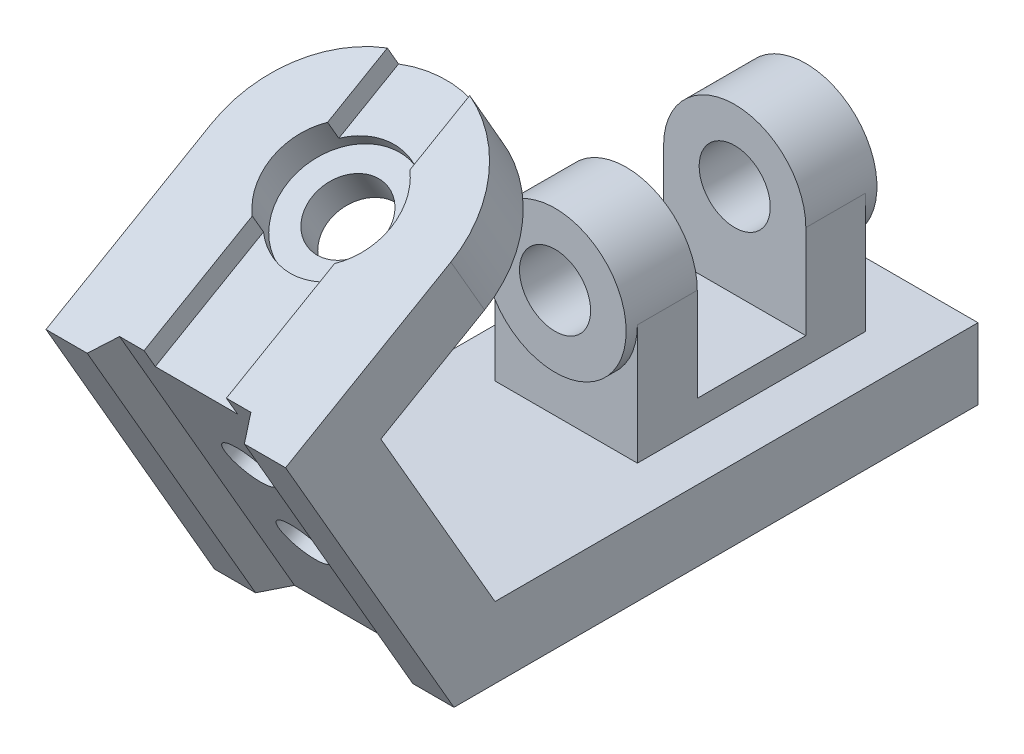
ISO-10303-21;
HEADER;
FILE_DESCRIPTION(('STEP AP214'),'2;1');
FILE_NAME('part.step','',(''),(''),'','','');
FILE_SCHEMA(('AUTOMOTIVE_DESIGN { 1 0 10303 214 1 1 1 1 }'));
ENDSEC;
DATA;
#1=APPLICATION_CONTEXT('core data for automotive mechanical design processes');
#2=APPLICATION_PROTOCOL_DEFINITION('international standard','automotive_design',2000,#1);
#3=PRODUCT_CONTEXT('',#1,'mechanical');
#4=PRODUCT('Part','Part','',(#3));
#5=PRODUCT_RELATED_PRODUCT_CATEGORY('part','',(#4));
#6=PRODUCT_DEFINITION_FORMATION('','',#4);
#7=PRODUCT_DEFINITION_CONTEXT('part definition',#1,'design');
#8=PRODUCT_DEFINITION('design','',#6,#7);
#9=PRODUCT_DEFINITION_SHAPE('','',#8);
#10=(LENGTH_UNIT() NAMED_UNIT(*) SI_UNIT(.MILLI.,.METRE.));
#11=(NAMED_UNIT(*) PLANE_ANGLE_UNIT() SI_UNIT($,.RADIAN.));
#12=(NAMED_UNIT(*) SI_UNIT($,.STERADIAN.) SOLID_ANGLE_UNIT());
#13=UNCERTAINTY_MEASURE_WITH_UNIT(LENGTH_MEASURE(1.E-05),#10,'distance_accuracy_value','');
#14=(GEOMETRIC_REPRESENTATION_CONTEXT(3) GLOBAL_UNCERTAINTY_ASSIGNED_CONTEXT((#13)) GLOBAL_UNIT_ASSIGNED_CONTEXT((#10,
#11,#12)) REPRESENTATION_CONTEXT('',''));
#15=CARTESIAN_POINT('',(0.,0.,0.));
#16=DIRECTION('',(0.,0.,1.));
#17=DIRECTION('',(1.,0.,0.));
#18=AXIS2_PLACEMENT_3D('',#15,#16,#17);
#19=CARTESIAN_POINT('',(19.,70.,-62.));
#20=DIRECTION('',(0.,0.,-1.));
#21=DIRECTION('',(-1.,0.,0.));
#22=AXIS2_PLACEMENT_3D('',#19,#20,#21);
#23=PLANE('',#22);
#24=CARTESIAN_POINT('',(0.,51.,-62.));
#25=DIRECTION('',(0.,0.,1.));
#26=DIRECTION('',(1.,0.,0.));
#27=AXIS2_PLACEMENT_3D('',#24,#25,#26);
#28=CIRCLE('',#27,19.);
#29=CARTESIAN_POINT('',(-19.,51.,-62.));
#30=VERTEX_POINT('',#29);
#31=CARTESIAN_POINT('',(19.,51.,-62.));
#32=VERTEX_POINT('',#31);
#33=EDGE_CURVE('E236',#30,#32,#28,.T.);
#34=ORIENTED_EDGE('',*,*,#33,.F.);
#35=DIRECTION('',(0.,-1.,0.));
#36=VECTOR('',#35,1.);
#37=CARTESIAN_POINT('',(-19.,70.,-62.));
#38=LINE('',#37,#36);
#39=CARTESIAN_POINT('',(-19.,19.,-62.));
#40=VERTEX_POINT('',#39);
#41=EDGE_CURVE('E219',#30,#40,#38,.T.);
#42=ORIENTED_EDGE('',*,*,#41,.T.);
#43=DIRECTION('',(-1.,0.,0.));
#44=VECTOR('',#43,1.);
#45=CARTESIAN_POINT('',(19.,19.,-62.));
#46=LINE('',#45,#44);
#47=CARTESIAN_POINT('',(19.,19.,-62.));
#48=VERTEX_POINT('',#47);
#49=EDGE_CURVE('E288',#48,#40,#46,.T.);
#50=ORIENTED_EDGE('',*,*,#49,.F.);
#51=DIRECTION('',(0.,-1.,0.));
#52=VECTOR('',#51,1.);
#53=CARTESIAN_POINT('',(19.,70.,-62.));
#54=LINE('',#53,#52);
#55=EDGE_CURVE('E242',#32,#48,#54,.T.);
#56=ORIENTED_EDGE('',*,*,#55,.F.);
#57=EDGE_LOOP('',(#34,#42,#50,#56));
#58=FACE_BOUND('',#57,.T.);
#59=ADVANCED_FACE('F34',(#58),#23,.F.);
#60=CARTESIAN_POINT('',(19.,19.,-123.));
#61=DIRECTION('',(0.,0.,1.));
#62=DIRECTION('',(1.,0.,0.));
#63=AXIS2_PLACEMENT_3D('',#60,#61,#62);
#64=PLANE('',#63);
#65=CARTESIAN_POINT('',(0.,51.,-123.));
#66=DIRECTION('',(0.,0.,-1.));
#67=DIRECTION('',(-1.,0.,0.));
#68=AXIS2_PLACEMENT_3D('',#65,#66,#67);
#69=CIRCLE('',#68,19.);
#70=CARTESIAN_POINT('',(19.,51.,-123.));
#71=VERTEX_POINT('',#70);
#72=CARTESIAN_POINT('',(-19.,51.,-123.));
#73=VERTEX_POINT('',#72);
#74=EDGE_CURVE('E247',#71,#73,#69,.T.);
#75=ORIENTED_EDGE('',*,*,#74,.F.);
#76=DIRECTION('',(0.,1.,0.));
#77=VECTOR('',#76,1.);
#78=CARTESIAN_POINT('',(19.,19.,-123.));
#79=LINE('',#78,#77);
#80=CARTESIAN_POINT('',(19.,19.,-123.));
#81=VERTEX_POINT('',#80);
#82=EDGE_CURVE('E262',#81,#71,#79,.T.);
#83=ORIENTED_EDGE('',*,*,#82,.F.);
#84=DIRECTION('',(-1.,0.,0.));
#85=VECTOR('',#84,1.);
#86=CARTESIAN_POINT('',(19.,19.,-123.));
#87=LINE('',#86,#85);
#88=CARTESIAN_POINT('',(-19.,19.,-123.));
#89=VERTEX_POINT('',#88);
#90=EDGE_CURVE('E285',#81,#89,#87,.T.);
#91=ORIENTED_EDGE('',*,*,#90,.T.);
#92=DIRECTION('',(0.,1.,0.));
#93=VECTOR('',#92,1.);
#94=CARTESIAN_POINT('',(-19.,19.,-123.));
#95=LINE('',#94,#93);
#96=EDGE_CURVE('E273',#89,#73,#95,.T.);
#97=ORIENTED_EDGE('',*,*,#96,.T.);
#98=EDGE_LOOP('',(#75,#83,#91,#97));
#99=FACE_BOUND('',#98,.T.);
#100=ADVANCED_FACE('F480',(#99),#64,.F.);
#101=CARTESIAN_POINT('',(0.,51.,-107.));
#102=DIRECTION('',(0.,0.,1.));
#103=DIRECTION('',(1.,0.,0.));
#104=AXIS2_PLACEMENT_3D('',#101,#102,#103);
#105=CYLINDRICAL_SURFACE('',#104,19.);
#106=DIRECTION('',(0.,0.,1.));
#107=VECTOR('',#106,1.);
#108=CARTESIAN_POINT('',(-19.,51.,0.));
#109=LINE('',#108,#107);
#110=CARTESIAN_POINT('',(-19.,51.,-107.));
#111=VERTEX_POINT('',#110);
#112=EDGE_CURVE('E55',#111,#73,#109,.F.);
#113=ORIENTED_EDGE('',*,*,#112,.F.);
#114=CARTESIAN_POINT('',(0.,51.,-107.));
#115=DIRECTION('',(0.,0.,-1.));
#116=DIRECTION('',(-1.,0.,0.));
#117=AXIS2_PLACEMENT_3D('',#114,#115,#116);
#118=CIRCLE('',#117,19.);
#119=CARTESIAN_POINT('',(19.,51.,-107.));
#120=VERTEX_POINT('',#119);
#121=EDGE_CURVE('E11',#120,#111,#118,.F.);
#122=ORIENTED_EDGE('',*,*,#121,.F.);
#123=DIRECTION('',(0.,0.,-1.));
#124=VECTOR('',#123,1.);
#125=CARTESIAN_POINT('',(19.,51.,-107.));
#126=LINE('',#125,#124);
#127=EDGE_CURVE('E43',#71,#120,#126,.F.);
#128=ORIENTED_EDGE('',*,*,#127,.F.);
#129=ORIENTED_EDGE('',*,*,#74,.T.);
#130=EDGE_LOOP('',(#113,#122,#128,#129));
#131=FACE_BOUND('',#130,.T.);
#132=CARTESIAN_POINT('',(0.,51.,-126.));
#133=DIRECTION('',(0.,0.,-1.));
#134=DIRECTION('',(-1.,0.,0.));
#135=AXIS2_PLACEMENT_3D('',#132,#133,#134);
#136=CIRCLE('',#135,19.);
#137=CARTESIAN_POINT('',(-19.,51.,-126.));
#138=VERTEX_POINT('',#137);
#139=EDGE_CURVE('E230',#138,#138,#136,.T.);
#140=ORIENTED_EDGE('',*,*,#139,.F.);
#141=EDGE_LOOP('',(#140));
#142=FACE_BOUND('',#141,.T.);
#143=ADVANCED_FACE('F37',(#131,#142),#105,.T.);
#144=CARTESIAN_POINT('',(0.,51.,-62.));
#145=DIRECTION('',(0.,0.,1.));
#146=DIRECTION('',(1.,0.,0.));
#147=AXIS2_PLACEMENT_3D('',#144,#145,#146);
#148=CYLINDRICAL_SURFACE('',#147,19.);
#149=DIRECTION('',(0.,0.,1.));
#150=VECTOR('',#149,1.);
#151=CARTESIAN_POINT('',(-19.,51.,0.));
#152=LINE('',#151,#150);
#153=CARTESIAN_POINT('',(-19.,51.,-78.));
#154=VERTEX_POINT('',#153);
#155=EDGE_CURVE('E223',#30,#154,#152,.F.);
#156=ORIENTED_EDGE('',*,*,#155,.F.);
#157=ORIENTED_EDGE('',*,*,#33,.T.);
#158=DIRECTION('',(0.,0.,-1.));
#159=VECTOR('',#158,1.);
#160=CARTESIAN_POINT('',(19.,51.,-62.));
#161=LINE('',#160,#159);
#162=CARTESIAN_POINT('',(19.,51.,-78.));
#163=VERTEX_POINT('',#162);
#164=EDGE_CURVE('E450',#163,#32,#161,.F.);
#165=ORIENTED_EDGE('',*,*,#164,.F.);
#166=CARTESIAN_POINT('',(0.,51.,-78.));
#167=DIRECTION('',(0.,0.,1.));
#168=DIRECTION('',(1.,0.,0.));
#169=AXIS2_PLACEMENT_3D('',#166,#167,#168);
#170=CIRCLE('',#169,19.);
#171=EDGE_CURVE('E238',#154,#163,#170,.F.);
#172=ORIENTED_EDGE('',*,*,#171,.F.);
#173=EDGE_LOOP('',(#156,#157,#165,#172));
#174=FACE_BOUND('',#173,.T.);
#175=CARTESIAN_POINT('',(0.,51.,-59.));
#176=DIRECTION('',(0.,0.,1.));
#177=DIRECTION('',(1.,0.,0.));
#178=AXIS2_PLACEMENT_3D('',#175,#176,#177);
#179=CIRCLE('',#178,19.);
#180=CARTESIAN_POINT('',(19.,51.,-59.));
#181=VERTEX_POINT('',#180);
#182=EDGE_CURVE('E243',#181,#181,#179,.T.);
#183=ORIENTED_EDGE('',*,*,#182,.F.);
#184=EDGE_LOOP('',(#183));
#185=FACE_BOUND('',#184,.T.);
#186=ADVANCED_FACE('F234',(#174,#185),#148,.T.);
#187=CARTESIAN_POINT('',(32.,77.9422863405996,44.9999999999998));
#188=DIRECTION('',(0.,0.499999999999998,-0.86602540378444));
#189=DIRECTION('',(0.,0.86602540378444,0.499999999999998));
#190=AXIS2_PLACEMENT_3D('',#187,#188,#189);
#191=PLANE('',#190);
#192=DIRECTION('',(-1.,0.,0.));
#193=VECTOR('',#192,1.);
#194=CARTESIAN_POINT('',(32.,0.,0.));
#195=LINE('',#194,#193);
#196=CARTESIAN_POINT('',(-21.,0.,0.));
#197=VERTEX_POINT('',#196);
#198=CARTESIAN_POINT('',(-32.,0.,0.));
#199=VERTEX_POINT('',#198);
#200=EDGE_CURVE('E422',#197,#199,#195,.T.);
#201=ORIENTED_EDGE('',*,*,#200,.F.);
#202=DIRECTION('',(0.,0.86602540378444,0.499999999999998));
#203=VECTOR('',#202,1.);
#204=CARTESIAN_POINT('',(-21.,-60.6217782649106,-34.9999999999998));
#205=LINE('',#204,#203);
#206=CARTESIAN_POINT('',(-21.,77.9422863405996,44.9999999999998));
#207=VERTEX_POINT('',#206);
#208=EDGE_CURVE('E310',#197,#207,#205,.T.);
#209=ORIENTED_EDGE('',*,*,#208,.T.);
#210=DIRECTION('',(-1.,0.,0.));
#211=VECTOR('',#210,1.);
#212=CARTESIAN_POINT('',(32.,77.9422863405996,44.9999999999998));
#213=LINE('',#212,#211);
#214=CARTESIAN_POINT('',(-32.,77.9422863405996,44.9999999999998));
#215=VERTEX_POINT('',#214);
#216=EDGE_CURVE('E391',#207,#215,#213,.T.);
#217=ORIENTED_EDGE('',*,*,#216,.T.);
#218=DIRECTION('',(0.,-0.86602540378444,-0.499999999999998));
#219=VECTOR('',#218,1.);
#220=CARTESIAN_POINT('',(-32.,77.9422863405996,44.9999999999998));
#221=LINE('',#220,#219);
#222=EDGE_CURVE('E371',#215,#199,#221,.T.);
#223=ORIENTED_EDGE('',*,*,#222,.T.);
#224=EDGE_LOOP('',(#201,#209,#217,#223));
#225=FACE_BOUND('',#224,.T.);
#226=ADVANCED_FACE('F548',(#225),#191,.F.);
#227=CARTESIAN_POINT('',(32.,119.4422863406,-26.880108514109));
#228=DIRECTION('',(0.,-0.86602540378444,-0.499999999999998));
#229=DIRECTION('',(0.,0.499999999999998,-0.86602540378444));
#230=AXIS2_PLACEMENT_3D('',#227,#228,#229);
#231=PLANE('',#230);
#232=DIRECTION('',(0.,0.499999999999998,-0.86602540378444));
#233=VECTOR('',#232,1.);
#234=CARTESIAN_POINT('',(11.,77.9422863405996,44.9999999999998));
#235=LINE('',#234,#233);
#236=CARTESIAN_POINT('',(11.,80.9422863405996,39.8038475772932));
#237=VERTEX_POINT('',#236);
#238=CARTESIAN_POINT('',(11.,97.6328113212885,10.8950103057422));
#239=VERTEX_POINT('',#238);
#240=EDGE_CURVE('E363',#237,#239,#235,.T.);
#241=ORIENTED_EDGE('',*,*,#240,.F.);
#242=DIRECTION('',(-1.,0.,0.));
#243=VECTOR('',#242,1.);
#244=CARTESIAN_POINT('',(17.5358983848623,80.9422863405996,39.8038475772932));
#245=LINE('',#244,#243);
#246=CARTESIAN_POINT('',(17.5358983848623,80.9422863405996,39.8038475772932));
#247=VERTEX_POINT('',#246);
#248=EDGE_CURVE('E308',#247,#237,#245,.T.);
#249=ORIENTED_EDGE('',*,*,#248,.F.);
#250=DIRECTION('',(-0.499999999999995,0.433012701892219,-0.750000000000004));
#251=VECTOR('',#250,1.);
#252=CARTESIAN_POINT('',(21.,77.9422863405996,44.9999999999998));
#253=LINE('',#252,#251);
#254=CARTESIAN_POINT('',(21.,77.9422863405996,44.9999999999998));
#255=VERTEX_POINT('',#254);
#256=EDGE_CURVE('E304',#255,#247,#253,.T.);
#257=ORIENTED_EDGE('',*,*,#256,.F.);
#258=CARTESIAN_POINT('',(32.,77.9422863405996,44.9999999999998));
#259=VERTEX_POINT('',#258);
#260=EDGE_CURVE('E407',#259,#255,#213,.T.);
#261=ORIENTED_EDGE('',*,*,#260,.F.);
#262=DIRECTION('',(0.,-0.499999999999998,0.86602540378444));
#263=VECTOR('',#262,1.);
#264=CARTESIAN_POINT('',(32.,119.4422863406,-26.880108514109));
#265=LINE('',#264,#263);
#266=CARTESIAN_POINT('',(32.,103.4422863406,0.832704406993078));
#267=VERTEX_POINT('',#266);
#268=EDGE_CURVE('E389',#267,#259,#265,.T.);
#269=ORIENTED_EDGE('',*,*,#268,.F.);
#270=CARTESIAN_POINT('',(0.,103.4422863406,0.832704406993078));
#271=DIRECTION('',(0.,-0.86602540378444,-0.499999999999998));
#272=DIRECTION('',(0.,0.499999999999998,-0.86602540378444));
#273=AXIS2_PLACEMENT_3D('',#270,#271,#272);
#274=CIRCLE('',#273,32.);
#275=CARTESIAN_POINT('',(11.,118.467265541916,-25.1913229523532));
#276=VERTEX_POINT('',#275);
#277=EDGE_CURVE('E433',#267,#276,#274,.F.);
#278=ORIENTED_EDGE('',*,*,#277,.T.);
#279=CARTESIAN_POINT('',(11.,109.251761359911,-9.229601491756));
#280=VERTEX_POINT('',#279);
#281=EDGE_CURVE('E352',#280,#276,#235,.T.);
#282=ORIENTED_EDGE('',*,*,#281,.F.);
#283=CARTESIAN_POINT('',(0.,103.4422863406,0.832704406993082));
#284=DIRECTION('',(0.,0.86602540378444,0.499999999999998));
#285=DIRECTION('',(0.,-0.499999999999998,0.86602540378444));
#286=AXIS2_PLACEMENT_3D('',#283,#284,#285);
#287=CIRCLE('',#286,16.);
#288=EDGE_CURVE('E329',#239,#280,#287,.T.);
#289=ORIENTED_EDGE('',*,*,#288,.F.);
#290=EDGE_LOOP('',(#241,#249,#257,#261,#269,#278,#282,#289));
#291=FACE_BOUND('',#290,.T.);
#292=ADVANCED_FACE('F545',(#291),#231,.F.);
#293=CARTESIAN_POINT('',(-11.,72.7461339178929,41.9999999999999));
#294=DIRECTION('',(-1.,0.,0.));
#295=DIRECTION('',(0.,0.,1.));
#296=AXIS2_PLACEMENT_3D('',#293,#294,#295);
#297=PLANE('',#296);
#298=DIRECTION('',(0.,-0.499999999999998,0.86602540378444));
#299=VECTOR('',#298,1.);
#300=CARTESIAN_POINT('',(-11.,77.9422863405996,44.9999999999998));
#301=LINE('',#300,#299);
#302=CARTESIAN_POINT('',(-11.,97.6328113212885,10.8950103057422));
#303=VERTEX_POINT('',#302);
#304=CARTESIAN_POINT('',(-11.,80.9422863405996,39.8038475772932));
#305=VERTEX_POINT('',#304);
#306=EDGE_CURVE('E365',#303,#305,#301,.T.);
#307=ORIENTED_EDGE('',*,*,#306,.T.);
#308=DIRECTION('',(0.,-0.86602540378444,-0.499999999999998));
#309=VECTOR('',#308,1.);
#310=CARTESIAN_POINT('',(-11.,75.7461339178929,36.8038475772932));
#311=LINE('',#310,#309);
#312=CARTESIAN_POINT('',(-11.,75.7461339178929,36.8038475772932));
#313=VERTEX_POINT('',#312);
#314=EDGE_CURVE('E322',#305,#313,#311,.T.);
#315=ORIENTED_EDGE('',*,*,#314,.T.);
#316=DIRECTION('',(0.,-0.499999999999998,0.86602540378444));
#317=VECTOR('',#316,1.);
#318=CARTESIAN_POINT('',(-11.,72.7461339178929,41.9999999999999));
#319=LINE('',#318,#317);
#320=CARTESIAN_POINT('',(-11.,92.4366588985819,7.89501030574217));
#321=VERTEX_POINT('',#320);
#322=EDGE_CURVE('E358',#321,#313,#319,.T.);
#323=ORIENTED_EDGE('',*,*,#322,.F.);
#324=DIRECTION('',(0.,0.86602540378444,0.499999999999998));
#325=VECTOR('',#324,1.);
#326=CARTESIAN_POINT('',(-11.,97.6328113212885,10.8950103057422));
#327=LINE('',#326,#325);
#328=EDGE_CURVE('E343',#321,#303,#327,.T.);
#329=ORIENTED_EDGE('',*,*,#328,.T.);
#330=EDGE_LOOP('',(#307,#315,#323,#329));
#331=FACE_BOUND('',#330,.T.);
#332=ADVANCED_FACE('F532',(#331),#297,.F.);
#333=CARTESIAN_POINT('',(11.,72.7461339178929,41.9999999999998));
#334=DIRECTION('',(1.,0.,0.));
#335=DIRECTION('',(0.,0.,-1.));
#336=AXIS2_PLACEMENT_3D('',#333,#334,#335);
#337=PLANE('',#336);
#338=DIRECTION('',(0.,0.499999999999998,-0.86602540378444));
#339=VECTOR('',#338,1.);
#340=CARTESIAN_POINT('',(11.,72.7461339178929,41.9999999999998));
#341=LINE('',#340,#339);
#342=CARTESIAN_POINT('',(11.,104.055608937204,-12.229601491756));
#343=VERTEX_POINT('',#342);
#344=CARTESIAN_POINT('',(11.,113.27111311921,-28.1913229523531));
#345=VERTEX_POINT('',#344);
#346=EDGE_CURVE('E356',#343,#345,#341,.T.);
#347=ORIENTED_EDGE('',*,*,#346,.F.);
#348=DIRECTION('',(0.,0.86602540378444,0.499999999999998));
#349=VECTOR('',#348,1.);
#350=CARTESIAN_POINT('',(11.,109.251761359911,-9.229601491756));
#351=LINE('',#350,#349);
#352=EDGE_CURVE('E349',#343,#280,#351,.T.);
#353=ORIENTED_EDGE('',*,*,#352,.T.);
#354=ORIENTED_EDGE('',*,*,#281,.T.);
#355=DIRECTION('',(0.,0.86602540378444,0.499999999999998));
#356=VECTOR('',#355,1.);
#357=CARTESIAN_POINT('',(11.,113.27111311921,-28.1913229523531));
#358=LINE('',#357,#356);
#359=EDGE_CURVE('E362',#345,#276,#358,.T.);
#360=ORIENTED_EDGE('',*,*,#359,.F.);
#361=EDGE_LOOP('',(#347,#353,#354,#360));
#362=FACE_BOUND('',#361,.T.);
#363=ADVANCED_FACE('F536',(#362),#337,.F.);
#364=CARTESIAN_POINT('',(0.,98.246133917893,-2.16729559300691));
#365=DIRECTION('',(0.,0.86602540378444,0.499999999999998));
#366=DIRECTION('',(0.,-0.499999999999998,0.86602540378444));
#367=AXIS2_PLACEMENT_3D('',#364,#365,#366);
#368=PLANE('',#367);
#369=CARTESIAN_POINT('',(0.,98.246133917893,-2.16729559300691));
#370=DIRECTION('',(0.,0.86602540378444,0.499999999999998));
#371=DIRECTION('',(0.,-0.499999999999998,0.86602540378444));
#372=AXIS2_PLACEMENT_3D('',#369,#370,#371);
#373=CIRCLE('',#372,16.);
#374=CARTESIAN_POINT('',(-11.,104.055608937204,-12.229601491756));
#375=VERTEX_POINT('',#374);
#376=EDGE_CURVE('E441',#343,#375,#373,.T.);
#377=ORIENTED_EDGE('',*,*,#376,.F.);
#378=ORIENTED_EDGE('',*,*,#346,.T.);
#379=CARTESIAN_POINT('',(0.,98.246133917893,-2.16729559300691));
#380=DIRECTION('',(0.,0.86602540378444,0.499999999999998));
#381=DIRECTION('',(0.,-0.499999999999998,0.86602540378444));
#382=AXIS2_PLACEMENT_3D('',#379,#380,#381);
#383=CIRCLE('',#382,32.);
#384=CARTESIAN_POINT('',(-11.,113.27111311921,-28.1913229523531));
#385=VERTEX_POINT('',#384);
#386=EDGE_CURVE('E355',#345,#385,#383,.T.);
#387=ORIENTED_EDGE('',*,*,#386,.T.);
#388=EDGE_CURVE('E359',#385,#375,#319,.T.);
#389=ORIENTED_EDGE('',*,*,#388,.T.);
#390=EDGE_LOOP('',(#377,#378,#387,#389));
#391=FACE_BOUND('',#390,.T.);
#392=ADVANCED_FACE('F526',(#391),#368,.T.);
#393=ORIENTED_EDGE('',*,*,#216,.F.);
#394=DIRECTION('',(-0.500000000000003,-0.433012701892217,0.749999999999999));
#395=VECTOR('',#394,1.);
#396=CARTESIAN_POINT('',(-17.5358983848622,80.9422863405996,39.8038475772932));
#397=LINE('',#396,#395);
#398=CARTESIAN_POINT('',(-17.5358983848622,80.9422863405996,39.8038475772932));
#399=VERTEX_POINT('',#398);
#400=EDGE_CURVE('E302',#399,#207,#397,.T.);
#401=ORIENTED_EDGE('',*,*,#400,.F.);
#402=EDGE_CURVE('E307',#305,#399,#245,.T.);
#403=ORIENTED_EDGE('',*,*,#402,.F.);
#404=ORIENTED_EDGE('',*,*,#306,.F.);
#405=CARTESIAN_POINT('',(-11.,109.251761359911,-9.229601491756));
#406=VERTEX_POINT('',#405);
#407=EDGE_CURVE('E328',#406,#303,#287,.T.);
#408=ORIENTED_EDGE('',*,*,#407,.F.);
#409=CARTESIAN_POINT('',(-11.,118.467265541916,-25.1913229523532));
#410=VERTEX_POINT('',#409);
#411=EDGE_CURVE('E366',#410,#406,#301,.T.);
#412=ORIENTED_EDGE('',*,*,#411,.F.);
#413=CARTESIAN_POINT('',(-32.,103.4422863406,0.832704406993078));
#414=VERTEX_POINT('',#413);
#415=EDGE_CURVE('E432',#410,#414,#274,.F.);
#416=ORIENTED_EDGE('',*,*,#415,.T.);
#417=DIRECTION('',(0.,-0.499999999999998,0.86602540378444));
#418=VECTOR('',#417,1.);
#419=CARTESIAN_POINT('',(-32.,119.4422863406,-26.880108514109));
#420=LINE('',#419,#418);
#421=EDGE_CURVE('E378',#414,#215,#420,.T.);
#422=ORIENTED_EDGE('',*,*,#421,.T.);
#423=EDGE_LOOP('',(#393,#401,#403,#404,#408,#412,#416,#422));
#424=FACE_BOUND('',#423,.T.);
#425=ADVANCED_FACE('F550',(#424),#231,.F.);
#426=CARTESIAN_POINT('',(0.,103.4422863406,0.832704406993078));
#427=DIRECTION('',(0.,0.866025403784444,0.49999999999999));
#428=DIRECTION('',(0.,-0.49999999999999,0.866025403784444));
#429=AXIS2_PLACEMENT_3D('',#426,#427,#428);
#430=CYLINDRICAL_SURFACE('',#429,32.);
#431=DIRECTION('',(0.,0.86602540378444,0.499999999999998));
#432=VECTOR('',#431,1.);
#433=CARTESIAN_POINT('',(-11.,113.27111311921,-28.1913229523531));
#434=LINE('',#433,#432);
#435=EDGE_CURVE('E369',#385,#410,#434,.T.);
#436=ORIENTED_EDGE('',*,*,#435,.F.);
#437=ORIENTED_EDGE('',*,*,#386,.F.);
#438=ORIENTED_EDGE('',*,*,#359,.T.);
#439=ORIENTED_EDGE('',*,*,#277,.F.);
#440=DIRECTION('',(0.,-0.866025403784444,-0.49999999999999));
#441=VECTOR('',#440,1.);
#442=CARTESIAN_POINT('',(32.,103.4422863406,0.832704406993078));
#443=LINE('',#442,#441);
#444=CARTESIAN_POINT('',(32.,87.85382907248,-8.16729559300656));
#445=VERTEX_POINT('',#444);
#446=EDGE_CURVE('E429',#445,#267,#443,.F.);
#447=ORIENTED_EDGE('',*,*,#446,.F.);
#448=CARTESIAN_POINT('',(0.,87.85382907248,-8.16729559300656));
#449=DIRECTION('',(0.,0.866025403784445,0.499999999999989));
#450=DIRECTION('',(0.,-0.499999999999989,0.866025403784445));
#451=AXIS2_PLACEMENT_3D('',#448,#449,#450);
#452=CIRCLE('',#451,32.);
#453=CARTESIAN_POINT('',(-32.,87.85382907248,-8.16729559300656));
#454=VERTEX_POINT('',#453);
#455=EDGE_CURVE('E436',#454,#445,#452,.F.);
#456=ORIENTED_EDGE('',*,*,#455,.F.);
#457=DIRECTION('',(0.,0.866025403784444,0.49999999999999));
#458=VECTOR('',#457,1.);
#459=CARTESIAN_POINT('',(-32.,25.4999999999993,-44.1672955930063));
#460=LINE('',#459,#458);
#461=EDGE_CURVE('E426',#414,#454,#460,.F.);
#462=ORIENTED_EDGE('',*,*,#461,.F.);
#463=ORIENTED_EDGE('',*,*,#415,.F.);
#464=EDGE_LOOP('',(#436,#437,#438,#439,#447,#456,#462,#463));
#465=FACE_BOUND('',#464,.T.);
#466=ADVANCED_FACE('F573',(#465),#430,.T.);
#467=ORIENTED_EDGE('',*,*,#260,.T.);
#468=DIRECTION('',(0.,0.86602540378444,0.499999999999998));
#469=VECTOR('',#468,1.);
#470=CARTESIAN_POINT('',(21.,-60.6217782649106,-34.9999999999998));
#471=LINE('',#470,#469);
#472=CARTESIAN_POINT('',(21.,0.,0.));
#473=VERTEX_POINT('',#472);
#474=EDGE_CURVE('E316',#473,#255,#471,.T.);
#475=ORIENTED_EDGE('',*,*,#474,.F.);
#476=CARTESIAN_POINT('',(32.,0.,0.));
#477=VERTEX_POINT('',#476);
#478=EDGE_CURVE('E423',#477,#473,#195,.T.);
#479=ORIENTED_EDGE('',*,*,#478,.F.);
#480=DIRECTION('',(0.,-0.86602540378444,-0.499999999999998));
#481=VECTOR('',#480,1.);
#482=CARTESIAN_POINT('',(32.,77.9422863405996,44.9999999999998));
#483=LINE('',#482,#481);
#484=EDGE_CURVE('E374',#259,#477,#483,.T.);
#485=ORIENTED_EDGE('',*,*,#484,.F.);
#486=EDGE_LOOP('',(#467,#475,#479,#485));
#487=FACE_BOUND('',#486,.T.);
#488=ADVANCED_FACE('F569',(#487),#191,.F.);
#489=CARTESIAN_POINT('',(32.,0.,0.));
#490=DIRECTION('',(0.,1.,0.));
#491=DIRECTION('',(0.,0.,1.));
#492=AXIS2_PLACEMENT_3D('',#489,#490,#491);
#493=PLANE('',#492);
#494=DIRECTION('',(-1.,0.,0.));
#495=VECTOR('',#494,1.);
#496=CARTESIAN_POINT('',(32.,0.,-6.92820323027554));
#497=LINE('',#496,#495);
#498=CARTESIAN_POINT('',(17.5358983848623,0.,-6.92820323027554));
#499=VERTEX_POINT('',#498);
#500=CARTESIAN_POINT('',(-17.5358983848622,0.,-6.92820323027554));
#501=VERTEX_POINT('',#500);
#502=EDGE_CURVE('E325',#499,#501,#497,.T.);
#503=ORIENTED_EDGE('',*,*,#502,.T.);
#504=DIRECTION('',(-0.447213595499961,0.,0.894427190999914));
#505=VECTOR('',#504,1.);
#506=CARTESIAN_POINT('',(-10.3999999999999,0.,-21.2000000000001));
#507=LINE('',#506,#505);
#508=EDGE_CURVE('E239',#501,#197,#507,.T.);
#509=ORIENTED_EDGE('',*,*,#508,.T.);
#510=ORIENTED_EDGE('',*,*,#200,.T.);
#511=DIRECTION('',(0.,0.,-1.));
#512=VECTOR('',#511,1.);
#513=CARTESIAN_POINT('',(-32.,0.,0.));
#514=LINE('',#513,#512);
#515=CARTESIAN_POINT('',(-32.,0.,-140.));
#516=VERTEX_POINT('',#515);
#517=EDGE_CURVE('E394',#199,#516,#514,.T.);
#518=ORIENTED_EDGE('',*,*,#517,.T.);
#519=DIRECTION('',(-1.,0.,0.));
#520=VECTOR('',#519,1.);
#521=CARTESIAN_POINT('',(32.,0.,-140.));
#522=LINE('',#521,#520);
#523=CARTESIAN_POINT('',(32.,0.,-140.));
#524=VERTEX_POINT('',#523);
#525=EDGE_CURVE('E419',#524,#516,#522,.T.);
#526=ORIENTED_EDGE('',*,*,#525,.F.);
#527=DIRECTION('',(0.,0.,-1.));
#528=VECTOR('',#527,1.);
#529=CARTESIAN_POINT('',(32.,0.,0.));
#530=LINE('',#529,#528);
#531=EDGE_CURVE('E377',#477,#524,#530,.T.);
#532=ORIENTED_EDGE('',*,*,#531,.F.);
#533=ORIENTED_EDGE('',*,*,#478,.T.);
#534=DIRECTION('',(-0.447213595499954,0.,-0.894427190999918));
#535=VECTOR('',#534,1.);
#536=CARTESIAN_POINT('',(23.2,0.,4.39999999999996));
#537=LINE('',#536,#535);
#538=EDGE_CURVE('E444',#473,#499,#537,.T.);
#539=ORIENTED_EDGE('',*,*,#538,.T.);
#540=EDGE_LOOP('',(#503,#509,#510,#518,#526,#532,#533,#539));
#541=FACE_BOUND('',#540,.T.);
#542=ADVANCED_FACE('F565',(#541),#493,.F.);
#543=CARTESIAN_POINT('',(32.,0.,-140.));
#544=DIRECTION('',(0.,0.,1.));
#545=DIRECTION('',(1.,0.,0.));
#546=AXIS2_PLACEMENT_3D('',#543,#544,#545);
#547=PLANE('',#546);
#548=DIRECTION('',(0.,1.,0.));
#549=VECTOR('',#548,1.);
#550=CARTESIAN_POINT('',(-32.,0.,-140.));
#551=LINE('',#550,#549);
#552=CARTESIAN_POINT('',(-32.,19.,-140.));
#553=VERTEX_POINT('',#552);
#554=EDGE_CURVE('E396',#516,#553,#551,.T.);
#555=ORIENTED_EDGE('',*,*,#554,.T.);
#556=DIRECTION('',(-1.,0.,0.));
#557=VECTOR('',#556,1.);
#558=CARTESIAN_POINT('',(32.,19.,-140.));
#559=LINE('',#558,#557);
#560=CARTESIAN_POINT('',(32.,19.,-140.));
#561=VERTEX_POINT('',#560);
#562=EDGE_CURVE('E416',#561,#553,#559,.T.);
#563=ORIENTED_EDGE('',*,*,#562,.F.);
#564=DIRECTION('',(0.,1.,0.));
#565=VECTOR('',#564,1.);
#566=CARTESIAN_POINT('',(32.,0.,-140.));
#567=LINE('',#566,#565);
#568=EDGE_CURVE('E380',#524,#561,#567,.T.);
#569=ORIENTED_EDGE('',*,*,#568,.F.);
#570=ORIENTED_EDGE('',*,*,#525,.T.);
#571=EDGE_LOOP('',(#555,#563,#569,#570));
#572=FACE_BOUND('',#571,.T.);
#573=ADVANCED_FACE('F561',(#572),#547,.F.);
#574=CARTESIAN_POINT('',(32.,19.,-140.));
#575=DIRECTION('',(0.,-1.,0.));
#576=DIRECTION('',(0.,0.,-1.));
#577=AXIS2_PLACEMENT_3D('',#574,#575,#576);
#578=PLANE('',#577);
#579=ORIENTED_EDGE('',*,*,#90,.F.);
#580=DIRECTION('',(0.,0.,-1.));
#581=VECTOR('',#580,1.);
#582=CARTESIAN_POINT('',(19.,19.,-62.));
#583=LINE('',#582,#581);
#584=EDGE_CURVE('E258',#48,#81,#583,.T.);
#585=ORIENTED_EDGE('',*,*,#584,.F.);
#586=ORIENTED_EDGE('',*,*,#49,.T.);
#587=DIRECTION('',(0.,0.,-1.));
#588=VECTOR('',#587,1.);
#589=CARTESIAN_POINT('',(-19.,19.,-62.));
#590=LINE('',#589,#588);
#591=EDGE_CURVE('E225',#40,#89,#590,.T.);
#592=ORIENTED_EDGE('',*,*,#591,.T.);
#593=EDGE_LOOP('',(#579,#585,#586,#592));
#594=FACE_BOUND('',#593,.T.);
#595=DIRECTION('',(0.,0.,1.));
#596=VECTOR('',#595,1.);
#597=CARTESIAN_POINT('',(-32.,19.,-140.));
#598=LINE('',#597,#596);
#599=CARTESIAN_POINT('',(-32.,19.,-10.9696551146032));
#600=VERTEX_POINT('',#599);
#601=EDGE_CURVE('E398',#553,#600,#598,.T.);
#602=ORIENTED_EDGE('',*,*,#601,.T.);
#603=DIRECTION('',(-1.,0.,0.));
#604=VECTOR('',#603,1.);
#605=CARTESIAN_POINT('',(32.,19.,-10.9696551146032));
#606=LINE('',#605,#604);
#607=CARTESIAN_POINT('',(32.,19.,-10.9696551146032));
#608=VERTEX_POINT('',#607);
#609=EDGE_CURVE('E413',#608,#600,#606,.T.);
#610=ORIENTED_EDGE('',*,*,#609,.F.);
#611=DIRECTION('',(0.,0.,1.));
#612=VECTOR('',#611,1.);
#613=CARTESIAN_POINT('',(32.,19.,-140.));
#614=LINE('',#613,#612);
#615=EDGE_CURVE('E382',#561,#608,#614,.T.);
#616=ORIENTED_EDGE('',*,*,#615,.F.);
#617=ORIENTED_EDGE('',*,*,#562,.T.);
#618=EDGE_LOOP('',(#602,#610,#616,#617));
#619=FACE_BOUND('',#618,.T.);
#620=ADVANCED_FACE('F557',(#594,#619),#578,.F.);
#621=CARTESIAN_POINT('',(32.,19.,-10.9696551146032));
#622=DIRECTION('',(0.,-0.499999999999999,0.866025403784439));
#623=DIRECTION('',(0.,-0.866025403784439,-0.499999999999999));
#624=AXIS2_PLACEMENT_3D('',#621,#622,#623);
#625=PLANE('',#624);
#626=CARTESIAN_POINT('',(0.,32.8826859021799,-2.95448267190464));
#627=DIRECTION('',(0.,-0.499999999999999,0.866025403784439));
#628=DIRECTION('',(0.,-0.866025403784439,-0.499999999999999));
#629=AXIS2_PLACEMENT_3D('',#626,#627,#628);
#630=CIRCLE('',#629,6.5);
#631=CARTESIAN_POINT('',(0.,27.2535207775811,-6.20448267190464));
#632=VERTEX_POINT('',#631);
#633=EDGE_CURVE('E293',#632,#632,#630,.F.);
#634=ORIENTED_EDGE('',*,*,#633,.F.);
#635=EDGE_LOOP('',(#634));
#636=FACE_BOUND('',#635,.T.);
#637=CARTESIAN_POINT('',(0.,57.9974226119287,11.5455173280953));
#638=DIRECTION('',(0.,-0.499999999999999,0.866025403784439));
#639=DIRECTION('',(0.,-0.866025403784439,-0.499999999999999));
#640=AXIS2_PLACEMENT_3D('',#637,#638,#639);
#641=CIRCLE('',#640,6.5);
#642=CARTESIAN_POINT('',(0.,52.3682574873298,8.29551732809534));
#643=VERTEX_POINT('',#642);
#644=EDGE_CURVE('E299',#643,#643,#641,.F.);
#645=ORIENTED_EDGE('',*,*,#644,.F.);
#646=EDGE_LOOP('',(#645));
#647=FACE_BOUND('',#646,.T.);
#648=DIRECTION('',(0.,0.866025403784439,0.499999999999999));
#649=VECTOR('',#648,1.);
#650=CARTESIAN_POINT('',(-32.,19.,-10.9696551146032));
#651=LINE('',#650,#649);
#652=CARTESIAN_POINT('',(-32.,71.8538290724803,19.5455173280957));
#653=VERTEX_POINT('',#652);
#654=EDGE_CURVE('E400',#600,#653,#651,.T.);
#655=ORIENTED_EDGE('',*,*,#654,.T.);
#656=DIRECTION('',(-1.,0.,0.));
#657=VECTOR('',#656,1.);
#658=CARTESIAN_POINT('',(32.,71.8538290724803,19.5455173280957));
#659=LINE('',#658,#657);
#660=CARTESIAN_POINT('',(32.,71.8538290724803,19.5455173280957));
#661=VERTEX_POINT('',#660);
#662=EDGE_CURVE('E410',#661,#653,#659,.T.);
#663=ORIENTED_EDGE('',*,*,#662,.F.);
#664=DIRECTION('',(0.,0.866025403784439,0.499999999999999));
#665=VECTOR('',#664,1.);
#666=CARTESIAN_POINT('',(32.,19.,-10.9696551146032));
#667=LINE('',#666,#665);
#668=EDGE_CURVE('E384',#608,#661,#667,.T.);
#669=ORIENTED_EDGE('',*,*,#668,.F.);
#670=ORIENTED_EDGE('',*,*,#609,.T.);
#671=EDGE_LOOP('',(#655,#663,#669,#670));
#672=FACE_BOUND('',#671,.T.);
#673=ADVANCED_FACE('F553',(#636,#647,#672),#625,.F.);
#674=CARTESIAN_POINT('',(32.,71.8538290724803,19.5455173280957));
#675=DIRECTION('',(0.,0.866025403784445,0.499999999999989));
#676=DIRECTION('',(0.,-0.499999999999989,0.866025403784445));
#677=AXIS2_PLACEMENT_3D('',#674,#675,#676);
#678=PLANE('',#677);
#679=CARTESIAN_POINT('',(0.,87.8538290724802,-8.16729559300662));
#680=DIRECTION('',(0.,0.86602540378444,0.499999999999998));
#681=DIRECTION('',(0.,-0.499999999999998,0.86602540378444));
#682=AXIS2_PLACEMENT_3D('',#679,#680,#681);
#683=CIRCLE('',#682,9.50000000000001);
#684=CARTESIAN_POINT('',(0.,83.1038290724802,0.0599457429455684));
#685=VERTEX_POINT('',#684);
#686=EDGE_CURVE('E337',#685,#685,#683,.T.);
#687=ORIENTED_EDGE('',*,*,#686,.T.);
#688=EDGE_LOOP('',(#687));
#689=FACE_BOUND('',#688,.T.);
#690=DIRECTION('',(0.,0.499999999999989,-0.866025403784445));
#691=VECTOR('',#690,1.);
#692=CARTESIAN_POINT('',(-32.,71.8538290724803,19.5455173280957));
#693=LINE('',#692,#691);
#694=EDGE_CURVE('E402',#653,#454,#693,.T.);
#695=ORIENTED_EDGE('',*,*,#694,.T.);
#696=ORIENTED_EDGE('',*,*,#455,.T.);
#697=DIRECTION('',(0.,0.499999999999989,-0.866025403784445));
#698=VECTOR('',#697,1.);
#699=CARTESIAN_POINT('',(32.,71.8538290724803,19.5455173280957));
#700=LINE('',#699,#698);
#701=EDGE_CURVE('E386',#661,#445,#700,.T.);
#702=ORIENTED_EDGE('',*,*,#701,.F.);
#703=ORIENTED_EDGE('',*,*,#662,.T.);
#704=EDGE_LOOP('',(#695,#696,#702,#703));
#705=FACE_BOUND('',#704,.T.);
#706=ADVANCED_FACE('F540',(#689,#705),#678,.F.);
#707=CARTESIAN_POINT('',(32.,0.,0.));
#708=DIRECTION('',(1.,0.,0.));
#709=DIRECTION('',(0.,0.,-1.));
#710=AXIS2_PLACEMENT_3D('',#707,#708,#709);
#711=PLANE('',#710);
#712=ORIENTED_EDGE('',*,*,#701,.T.);
#713=ORIENTED_EDGE('',*,*,#446,.T.);
#714=ORIENTED_EDGE('',*,*,#268,.T.);
#715=ORIENTED_EDGE('',*,*,#484,.T.);
#716=ORIENTED_EDGE('',*,*,#531,.T.);
#717=ORIENTED_EDGE('',*,*,#568,.T.);
#718=ORIENTED_EDGE('',*,*,#615,.T.);
#719=ORIENTED_EDGE('',*,*,#668,.T.);
#720=EDGE_LOOP('',(#712,#713,#714,#715,#716,#717,#718,#719));
#721=FACE_BOUND('',#720,.T.);
#722=ADVANCED_FACE('F537',(#721),#711,.T.);
#723=CARTESIAN_POINT('',(-32.,0.,0.));
#724=DIRECTION('',(1.,0.,0.));
#725=DIRECTION('',(0.,0.,-1.));
#726=AXIS2_PLACEMENT_3D('',#723,#724,#725);
#727=PLANE('',#726);
#728=ORIENTED_EDGE('',*,*,#421,.F.);
#729=ORIENTED_EDGE('',*,*,#461,.T.);
#730=ORIENTED_EDGE('',*,*,#694,.F.);
#731=ORIENTED_EDGE('',*,*,#654,.F.);
#732=ORIENTED_EDGE('',*,*,#601,.F.);
#733=ORIENTED_EDGE('',*,*,#554,.F.);
#734=ORIENTED_EDGE('',*,*,#517,.F.);
#735=ORIENTED_EDGE('',*,*,#222,.F.);
#736=EDGE_LOOP('',(#728,#729,#730,#731,#732,#733,#734,#735));
#737=FACE_BOUND('',#736,.T.);
#738=ADVANCED_FACE('F530',(#737),#727,.F.);
#739=ORIENTED_EDGE('',*,*,#411,.T.);
#740=DIRECTION('',(0.,0.86602540378444,0.499999999999998));
#741=VECTOR('',#740,1.);
#742=CARTESIAN_POINT('',(-11.,109.251761359911,-9.229601491756));
#743=LINE('',#742,#741);
#744=EDGE_CURVE('E346',#406,#375,#743,.F.);
#745=ORIENTED_EDGE('',*,*,#744,.T.);
#746=ORIENTED_EDGE('',*,*,#388,.F.);
#747=ORIENTED_EDGE('',*,*,#435,.T.);
#748=EDGE_LOOP('',(#739,#745,#746,#747));
#749=FACE_BOUND('',#748,.T.);
#750=ADVANCED_FACE('F527',(#749),#297,.F.);
#751=CARTESIAN_POINT('',(11.,75.7461339178929,36.8038475772932));
#752=VERTEX_POINT('',#751);
#753=CARTESIAN_POINT('',(11.,92.4366588985819,7.89501030574217));
#754=VERTEX_POINT('',#753);
#755=EDGE_CURVE('E353',#752,#754,#341,.T.);
#756=ORIENTED_EDGE('',*,*,#755,.F.);
#757=DIRECTION('',(0.,0.86602540378444,0.499999999999998));
#758=VECTOR('',#757,1.);
#759=CARTESIAN_POINT('',(11.,75.7461339178929,36.8038475772932));
#760=LINE('',#759,#758);
#761=EDGE_CURVE('E313',#752,#237,#760,.T.);
#762=ORIENTED_EDGE('',*,*,#761,.T.);
#763=ORIENTED_EDGE('',*,*,#240,.T.);
#764=DIRECTION('',(0.,0.86602540378444,0.499999999999998));
#765=VECTOR('',#764,1.);
#766=CARTESIAN_POINT('',(11.,97.6328113212885,10.8950103057422));
#767=LINE('',#766,#765);
#768=EDGE_CURVE('E340',#239,#754,#767,.F.);
#769=ORIENTED_EDGE('',*,*,#768,.T.);
#770=EDGE_LOOP('',(#756,#762,#763,#769));
#771=FACE_BOUND('',#770,.T.);
#772=ADVANCED_FACE('F524',(#771),#337,.F.);
#773=DIRECTION('',(-1.,0.,0.));
#774=VECTOR('',#773,1.);
#775=CARTESIAN_POINT('',(0.,75.7461339178929,36.8038475772932));
#776=LINE('',#775,#774);
#777=EDGE_CURVE('E442',#752,#313,#776,.T.);
#778=ORIENTED_EDGE('',*,*,#777,.F.);
#779=ORIENTED_EDGE('',*,*,#755,.T.);
#780=EDGE_CURVE('E438',#321,#754,#373,.T.);
#781=ORIENTED_EDGE('',*,*,#780,.F.);
#782=ORIENTED_EDGE('',*,*,#322,.T.);
#783=EDGE_LOOP('',(#778,#779,#781,#782));
#784=FACE_BOUND('',#783,.T.);
#785=ADVANCED_FACE('F514',(#784),#368,.T.);
#786=CARTESIAN_POINT('',(0.,103.4422863406,0.832704406993082));
#787=DIRECTION('',(0.,0.86602540378444,0.499999999999998));
#788=DIRECTION('',(0.,-0.499999999999998,0.86602540378444));
#789=AXIS2_PLACEMENT_3D('',#786,#787,#788);
#790=CYLINDRICAL_SURFACE('',#789,16.);
#791=CARTESIAN_POINT('',(0.,95.6480577065397,-3.6672955930069));
#792=DIRECTION('',(0.,0.86602540378444,0.499999999999998));
#793=DIRECTION('',(0.,-0.499999999999998,0.86602540378444));
#794=AXIS2_PLACEMENT_3D('',#791,#792,#793);
#795=CIRCLE('',#794,16.);
#796=CARTESIAN_POINT('',(0.,87.6480577065397,10.1891108675441));
#797=VERTEX_POINT('',#796);
#798=EDGE_CURVE('E331',#797,#797,#795,.T.);
#799=ORIENTED_EDGE('',*,*,#798,.F.);
#800=EDGE_LOOP('',(#799));
#801=FACE_BOUND('',#800,.T.);
#802=ORIENTED_EDGE('',*,*,#376,.T.);
#803=ORIENTED_EDGE('',*,*,#744,.F.);
#804=ORIENTED_EDGE('',*,*,#407,.T.);
#805=ORIENTED_EDGE('',*,*,#328,.F.);
#806=ORIENTED_EDGE('',*,*,#780,.T.);
#807=ORIENTED_EDGE('',*,*,#768,.F.);
#808=ORIENTED_EDGE('',*,*,#288,.T.);
#809=ORIENTED_EDGE('',*,*,#352,.F.);
#810=EDGE_LOOP('',(#802,#803,#804,#805,#806,#807,#808,#809));
#811=FACE_BOUND('',#810,.T.);
#812=ADVANCED_FACE('F510',(#801,#811),#790,.F.);
#813=CARTESIAN_POINT('',(0.,103.4422863406,0.832704406993082));
#814=DIRECTION('',(0.,0.86602540378444,0.499999999999998));
#815=DIRECTION('',(0.,-0.499999999999998,0.86602540378444));
#816=AXIS2_PLACEMENT_3D('',#813,#814,#815);
#817=CYLINDRICAL_SURFACE('',#816,9.50000000000001);
#818=ORIENTED_EDGE('',*,*,#686,.F.);
#819=EDGE_LOOP('',(#818));
#820=FACE_BOUND('',#819,.T.);
#821=CARTESIAN_POINT('',(0.,95.6480577065397,-3.6672955930069));
#822=DIRECTION('',(0.,0.86602540378444,0.499999999999998));
#823=DIRECTION('',(0.,-0.499999999999998,0.86602540378444));
#824=AXIS2_PLACEMENT_3D('',#821,#822,#823);
#825=CIRCLE('',#824,9.50000000000001);
#826=CARTESIAN_POINT('',(0.,90.8980577065397,4.55994574294528));
#827=VERTEX_POINT('',#826);
#828=EDGE_CURVE('E334',#827,#827,#825,.T.);
#829=ORIENTED_EDGE('',*,*,#828,.T.);
#830=EDGE_LOOP('',(#829));
#831=FACE_BOUND('',#830,.T.);
#832=ADVANCED_FACE('F513',(#820,#831),#817,.F.);
#833=CARTESIAN_POINT('',(9.50000000000001,95.6480577065397,-3.6672955930069));
#834=DIRECTION('',(0.,-0.86602540378444,-0.499999999999998));
#835=DIRECTION('',(0.,0.499999999999998,-0.86602540378444));
#836=AXIS2_PLACEMENT_3D('',#833,#834,#835);
#837=PLANE('',#836);
#838=ORIENTED_EDGE('',*,*,#828,.F.);
#839=EDGE_LOOP('',(#838));
#840=FACE_BOUND('',#839,.T.);
#841=ORIENTED_EDGE('',*,*,#798,.T.);
#842=EDGE_LOOP('',(#841));
#843=FACE_BOUND('',#842,.T.);
#844=ADVANCED_FACE('F508',(#840,#843),#837,.F.);
#845=CARTESIAN_POINT('',(-17.5358983848622,-57.6217782649106,-40.1961524227064));
#846=DIRECTION('',(-0.866025403784437,0.250000000000001,-0.433012701892223));
#847=DIRECTION('',(-0.447213595499961,0.,0.894427190999914));
#848=AXIS2_PLACEMENT_3D('',#845,#846,#847);
#849=PLANE('',#848);
#850=DIRECTION('',(0.,0.86602540378444,0.499999999999998));
#851=VECTOR('',#850,1.);
#852=CARTESIAN_POINT('',(-17.5358983848622,-57.6217782649106,-40.1961524227064));
#853=LINE('',#852,#851);
#854=EDGE_CURVE('E311',#501,#399,#853,.T.);
#855=ORIENTED_EDGE('',*,*,#854,.T.);
#856=ORIENTED_EDGE('',*,*,#400,.T.);
#857=ORIENTED_EDGE('',*,*,#208,.F.);
#858=ORIENTED_EDGE('',*,*,#508,.F.);
#859=EDGE_LOOP('',(#855,#856,#857,#858));
#860=FACE_BOUND('',#859,.T.);
#861=ADVANCED_FACE('F504',(#860),#849,.F.);
#862=CARTESIAN_POINT('',(21.,-60.6217782649106,-34.9999999999998));
#863=DIRECTION('',(0.866025403784441,0.249999999999997,-0.433012701892216));
#864=DIRECTION('',(-0.447213595499954,0.,-0.894427190999918));
#865=AXIS2_PLACEMENT_3D('',#862,#863,#864);
#866=PLANE('',#865);
#867=ORIENTED_EDGE('',*,*,#474,.T.);
#868=ORIENTED_EDGE('',*,*,#256,.T.);
#869=DIRECTION('',(0.,0.86602540378444,0.499999999999998));
#870=VECTOR('',#869,1.);
#871=CARTESIAN_POINT('',(17.5358983848623,-57.6217782649106,-40.1961524227064));
#872=LINE('',#871,#870);
#873=EDGE_CURVE('E314',#499,#247,#872,.T.);
#874=ORIENTED_EDGE('',*,*,#873,.F.);
#875=ORIENTED_EDGE('',*,*,#538,.F.);
#876=EDGE_LOOP('',(#867,#868,#874,#875));
#877=FACE_BOUND('',#876,.T.);
#878=ADVANCED_FACE('F500',(#877),#866,.F.);
#879=CARTESIAN_POINT('',(17.5358983848623,-57.6217782649106,-40.1961524227064));
#880=DIRECTION('',(0.,0.499999999999998,-0.86602540378444));
#881=DIRECTION('',(0.,0.86602540378444,0.499999999999998));
#882=AXIS2_PLACEMENT_3D('',#879,#880,#881);
#883=PLANE('',#882);
#884=CARTESIAN_POINT('',(0.,26.3826859021798,8.30384757729328));
#885=DIRECTION('',(0.,-0.499999999999998,0.86602540378444));
#886=DIRECTION('',(0.,-0.86602540378444,-0.499999999999998));
#887=AXIS2_PLACEMENT_3D('',#884,#885,#886);
#888=CIRCLE('',#887,6.5);
#889=CARTESIAN_POINT('',(0.,20.753520777581,5.05384757729329));
#890=VERTEX_POINT('',#889);
#891=EDGE_CURVE('E290',#890,#890,#888,.T.);
#892=ORIENTED_EDGE('',*,*,#891,.F.);
#893=EDGE_LOOP('',(#892));
#894=FACE_BOUND('',#893,.T.);
#895=CARTESIAN_POINT('',(0.,51.4974226119286,22.8038475772932));
#896=DIRECTION('',(0.,-0.499999999999998,0.86602540378444));
#897=DIRECTION('',(0.,-0.86602540378444,-0.499999999999998));
#898=AXIS2_PLACEMENT_3D('',#895,#896,#897);
#899=CIRCLE('',#898,6.5);
#900=CARTESIAN_POINT('',(0.,45.8682574873297,19.5538475772932));
#901=VERTEX_POINT('',#900);
#902=EDGE_CURVE('E296',#901,#901,#899,.T.);
#903=ORIENTED_EDGE('',*,*,#902,.F.);
#904=EDGE_LOOP('',(#903));
#905=FACE_BOUND('',#904,.T.);
#906=ORIENTED_EDGE('',*,*,#873,.T.);
#907=ORIENTED_EDGE('',*,*,#248,.T.);
#908=ORIENTED_EDGE('',*,*,#761,.F.);
#909=ORIENTED_EDGE('',*,*,#777,.T.);
#910=ORIENTED_EDGE('',*,*,#314,.F.);
#911=ORIENTED_EDGE('',*,*,#402,.T.);
#912=ORIENTED_EDGE('',*,*,#854,.F.);
#913=ORIENTED_EDGE('',*,*,#502,.F.);
#914=EDGE_LOOP('',(#906,#907,#908,#909,#910,#911,#912,#913));
#915=FACE_BOUND('',#914,.T.);
#916=ADVANCED_FACE('F496',(#894,#905,#915),#883,.F.);
#917=CARTESIAN_POINT('',(0.,67.1898107673538,-4.37616599999537));
#918=DIRECTION('',(0.,-0.499999999999998,0.86602540378444));
#919=DIRECTION('',(0.,-0.86602540378444,-0.499999999999998));
#920=AXIS2_PLACEMENT_3D('',#917,#918,#919);
#921=CYLINDRICAL_SURFACE('',#920,6.5);
#922=ORIENTED_EDGE('',*,*,#644,.T.);
#923=EDGE_LOOP('',(#922));
#924=FACE_BOUND('',#923,.T.);
#925=ORIENTED_EDGE('',*,*,#902,.T.);
#926=EDGE_LOOP('',(#925));
#927=FACE_BOUND('',#926,.T.);
#928=ADVANCED_FACE('F492',(#924,#927),#921,.F.);
#929=CARTESIAN_POINT('',(0.,42.075074057605,-18.8761659999953));
#930=DIRECTION('',(0.,-0.499999999999998,0.86602540378444));
#931=DIRECTION('',(0.,-0.86602540378444,-0.499999999999998));
#932=AXIS2_PLACEMENT_3D('',#929,#930,#931);
#933=CYLINDRICAL_SURFACE('',#932,6.5);
#934=ORIENTED_EDGE('',*,*,#633,.T.);
#935=EDGE_LOOP('',(#934));
#936=FACE_BOUND('',#935,.T.);
#937=ORIENTED_EDGE('',*,*,#891,.T.);
#938=EDGE_LOOP('',(#937));
#939=FACE_BOUND('',#938,.T.);
#940=ADVANCED_FACE('F489',(#936,#939),#933,.F.);
#941=CARTESIAN_POINT('',(19.,70.,-107.));
#942=DIRECTION('',(0.,0.,-1.));
#943=DIRECTION('',(-1.,0.,0.));
#944=AXIS2_PLACEMENT_3D('',#941,#942,#943);
#945=PLANE('',#944);
#946=CARTESIAN_POINT('',(0.,51.,-107.));
#947=DIRECTION('',(0.,0.,-1.));
#948=DIRECTION('',(-1.,0.,0.));
#949=AXIS2_PLACEMENT_3D('',#946,#947,#948);
#950=CIRCLE('',#949,9.5);
#951=CARTESIAN_POINT('',(-9.5,51.,-107.));
#952=VERTEX_POINT('',#951);
#953=EDGE_CURVE('E244',#952,#952,#950,.T.);
#954=ORIENTED_EDGE('',*,*,#953,.T.);
#955=EDGE_LOOP('',(#954));
#956=FACE_BOUND('',#955,.T.);
#957=DIRECTION('',(0.,-1.,0.));
#958=VECTOR('',#957,1.);
#959=CARTESIAN_POINT('',(19.,70.,-107.));
#960=LINE('',#959,#958);
#961=CARTESIAN_POINT('',(19.,26.,-107.));
#962=VERTEX_POINT('',#961);
#963=EDGE_CURVE('E264',#120,#962,#960,.T.);
#964=ORIENTED_EDGE('',*,*,#963,.F.);
#965=ORIENTED_EDGE('',*,*,#121,.T.);
#966=DIRECTION('',(0.,-1.,0.));
#967=VECTOR('',#966,1.);
#968=CARTESIAN_POINT('',(-19.,70.,-107.));
#969=LINE('',#968,#967);
#970=CARTESIAN_POINT('',(-19.,26.,-107.));
#971=VERTEX_POINT('',#970);
#972=EDGE_CURVE('E275',#111,#971,#969,.T.);
#973=ORIENTED_EDGE('',*,*,#972,.T.);
#974=DIRECTION('',(-1.,0.,0.));
#975=VECTOR('',#974,1.);
#976=CARTESIAN_POINT('',(19.,26.,-107.));
#977=LINE('',#976,#975);
#978=EDGE_CURVE('E282',#962,#971,#977,.T.);
#979=ORIENTED_EDGE('',*,*,#978,.F.);
#980=EDGE_LOOP('',(#964,#965,#973,#979));
#981=FACE_BOUND('',#980,.T.);
#982=ADVANCED_FACE('F459',(#956,#981),#945,.F.);
#983=CARTESIAN_POINT('',(19.,26.,-107.));
#984=DIRECTION('',(0.,-1.,0.));
#985=DIRECTION('',(0.,0.,-1.));
#986=AXIS2_PLACEMENT_3D('',#983,#984,#985);
#987=PLANE('',#986);
#988=DIRECTION('',(0.,0.,1.));
#989=VECTOR('',#988,1.);
#990=CARTESIAN_POINT('',(-19.,26.,-107.));
#991=LINE('',#990,#989);
#992=CARTESIAN_POINT('',(-19.,26.,-78.));
#993=VERTEX_POINT('',#992);
#994=EDGE_CURVE('E277',#971,#993,#991,.T.);
#995=ORIENTED_EDGE('',*,*,#994,.T.);
#996=DIRECTION('',(-1.,0.,0.));
#997=VECTOR('',#996,1.);
#998=CARTESIAN_POINT('',(19.,26.,-78.));
#999=LINE('',#998,#997);
#1000=CARTESIAN_POINT('',(19.,26.,-78.));
#1001=VERTEX_POINT('',#1000);
#1002=EDGE_CURVE('E270',#1001,#993,#999,.T.);
#1003=ORIENTED_EDGE('',*,*,#1002,.F.);
#1004=DIRECTION('',(0.,0.,1.));
#1005=VECTOR('',#1004,1.);
#1006=CARTESIAN_POINT('',(19.,26.,-107.));
#1007=LINE('',#1006,#1005);
#1008=EDGE_CURVE('E266',#962,#1001,#1007,.T.);
#1009=ORIENTED_EDGE('',*,*,#1008,.F.);
#1010=ORIENTED_EDGE('',*,*,#978,.T.);
#1011=EDGE_LOOP('',(#995,#1003,#1009,#1010));
#1012=FACE_BOUND('',#1011,.T.);
#1013=ADVANCED_FACE('F464',(#1012),#987,.F.);
#1014=CARTESIAN_POINT('',(19.,26.,-78.));
#1015=DIRECTION('',(0.,0.,1.));
#1016=DIRECTION('',(1.,0.,0.));
#1017=AXIS2_PLACEMENT_3D('',#1014,#1015,#1016);
#1018=PLANE('',#1017);
#1019=CARTESIAN_POINT('',(0.,51.,-78.));
#1020=DIRECTION('',(0.,0.,1.));
#1021=DIRECTION('',(1.,0.,0.));
#1022=AXIS2_PLACEMENT_3D('',#1019,#1020,#1021);
#1023=CIRCLE('',#1022,9.5);
#1024=CARTESIAN_POINT('',(9.5,51.,-78.));
#1025=VERTEX_POINT('',#1024);
#1026=EDGE_CURVE('E250',#1025,#1025,#1023,.T.);
#1027=ORIENTED_EDGE('',*,*,#1026,.T.);
#1028=EDGE_LOOP('',(#1027));
#1029=FACE_BOUND('',#1028,.T.);
#1030=DIRECTION('',(0.,1.,0.));
#1031=VECTOR('',#1030,1.);
#1032=CARTESIAN_POINT('',(-19.,26.,-78.));
#1033=LINE('',#1032,#1031);
#1034=EDGE_CURVE('E259',#993,#154,#1033,.T.);
#1035=ORIENTED_EDGE('',*,*,#1034,.T.);
#1036=ORIENTED_EDGE('',*,*,#171,.T.);
#1037=DIRECTION('',(0.,1.,0.));
#1038=VECTOR('',#1037,1.);
#1039=CARTESIAN_POINT('',(19.,26.,-78.));
#1040=LINE('',#1039,#1038);
#1041=EDGE_CURVE('E268',#1001,#163,#1040,.T.);
#1042=ORIENTED_EDGE('',*,*,#1041,.F.);
#1043=ORIENTED_EDGE('',*,*,#1002,.T.);
#1044=EDGE_LOOP('',(#1035,#1036,#1042,#1043));
#1045=FACE_BOUND('',#1044,.T.);
#1046=ADVANCED_FACE('F467',(#1029,#1045),#1018,.F.);
#1047=CARTESIAN_POINT('',(19.,0.,0.));
#1048=DIRECTION('',(1.,0.,0.));
#1049=DIRECTION('',(0.,0.,-1.));
#1050=AXIS2_PLACEMENT_3D('',#1047,#1048,#1049);
#1051=PLANE('',#1050);
#1052=ORIENTED_EDGE('',*,*,#82,.T.);
#1053=ORIENTED_EDGE('',*,*,#127,.T.);
#1054=ORIENTED_EDGE('',*,*,#963,.T.);
#1055=ORIENTED_EDGE('',*,*,#1008,.T.);
#1056=ORIENTED_EDGE('',*,*,#1041,.T.);
#1057=ORIENTED_EDGE('',*,*,#164,.T.);
#1058=ORIENTED_EDGE('',*,*,#55,.T.);
#1059=ORIENTED_EDGE('',*,*,#584,.T.);
#1060=EDGE_LOOP('',(#1052,#1053,#1054,#1055,#1056,#1057,#1058,#1059));
#1061=FACE_BOUND('',#1060,.T.);
#1062=ADVANCED_FACE('F454',(#1061),#1051,.T.);
#1063=CARTESIAN_POINT('',(-19.,0.,0.));
#1064=DIRECTION('',(1.,0.,0.));
#1065=DIRECTION('',(0.,0.,-1.));
#1066=AXIS2_PLACEMENT_3D('',#1063,#1064,#1065);
#1067=PLANE('',#1066);
#1068=ORIENTED_EDGE('',*,*,#972,.F.);
#1069=ORIENTED_EDGE('',*,*,#112,.T.);
#1070=ORIENTED_EDGE('',*,*,#96,.F.);
#1071=ORIENTED_EDGE('',*,*,#591,.F.);
#1072=ORIENTED_EDGE('',*,*,#41,.F.);
#1073=ORIENTED_EDGE('',*,*,#155,.T.);
#1074=ORIENTED_EDGE('',*,*,#1034,.F.);
#1075=ORIENTED_EDGE('',*,*,#994,.F.);
#1076=EDGE_LOOP('',(#1068,#1069,#1070,#1071,#1072,#1073,#1074,#1075));
#1077=FACE_BOUND('',#1076,.T.);
#1078=ADVANCED_FACE('F221',(#1077),#1067,.F.);
#1079=CARTESIAN_POINT('',(0.,51.,-126.));
#1080=DIRECTION('',(0.,0.,-1.));
#1081=DIRECTION('',(-1.,0.,0.));
#1082=AXIS2_PLACEMENT_3D('',#1079,#1080,#1081);
#1083=PLANE('',#1082);
#1084=CARTESIAN_POINT('',(0.,51.,-126.));
#1085=DIRECTION('',(0.,0.,-1.));
#1086=DIRECTION('',(-1.,0.,0.));
#1087=AXIS2_PLACEMENT_3D('',#1084,#1085,#1086);
#1088=CIRCLE('',#1087,9.5);
#1089=CARTESIAN_POINT('',(-9.5,51.,-126.));
#1090=VERTEX_POINT('',#1089);
#1091=EDGE_CURVE('E617',#1090,#1090,#1088,.F.);
#1092=ORIENTED_EDGE('',*,*,#1091,.T.);
#1093=EDGE_LOOP('',(#1092));
#1094=FACE_BOUND('',#1093,.T.);
#1095=ORIENTED_EDGE('',*,*,#139,.T.);
#1096=EDGE_LOOP('',(#1095));
#1097=FACE_BOUND('',#1096,.T.);
#1098=ADVANCED_FACE('F594',(#1094,#1097),#1083,.T.);
#1099=CARTESIAN_POINT('',(0.,51.,-59.));
#1100=DIRECTION('',(0.,0.,1.));
#1101=DIRECTION('',(1.,0.,0.));
#1102=AXIS2_PLACEMENT_3D('',#1099,#1100,#1101);
#1103=PLANE('',#1102);
#1104=CARTESIAN_POINT('',(0.,51.,-59.));
#1105=DIRECTION('',(0.,0.,1.));
#1106=DIRECTION('',(1.,0.,0.));
#1107=AXIS2_PLACEMENT_3D('',#1104,#1105,#1106);
#1108=CIRCLE('',#1107,9.5);
#1109=CARTESIAN_POINT('',(9.5,51.,-59.));
#1110=VERTEX_POINT('',#1109);
#1111=EDGE_CURVE('E913',#1110,#1110,#1108,.T.);
#1112=ORIENTED_EDGE('',*,*,#1111,.F.);
#1113=EDGE_LOOP('',(#1112));
#1114=FACE_BOUND('',#1113,.T.);
#1115=ORIENTED_EDGE('',*,*,#182,.T.);
#1116=EDGE_LOOP('',(#1115));
#1117=FACE_BOUND('',#1116,.T.);
#1118=ADVANCED_FACE('F596',(#1114,#1117),#1103,.T.);
#1119=CARTESIAN_POINT('',(0.,51.,-152.870057685089));
#1120=DIRECTION('',(0.,0.,1.));
#1121=DIRECTION('',(1.,0.,0.));
#1122=AXIS2_PLACEMENT_3D('',#1119,#1120,#1121);
#1123=CYLINDRICAL_SURFACE('',#1122,9.5);
#1124=ORIENTED_EDGE('',*,*,#1111,.T.);
#1125=EDGE_LOOP('',(#1124));
#1126=FACE_BOUND('',#1125,.T.);
#1127=ORIENTED_EDGE('',*,*,#1026,.F.);
#1128=EDGE_LOOP('',(#1127));
#1129=FACE_BOUND('',#1128,.T.);
#1130=ADVANCED_FACE('F603',(#1126,#1129),#1123,.F.);
#1131=ORIENTED_EDGE('',*,*,#1091,.F.);
#1132=EDGE_LOOP('',(#1131));
#1133=FACE_BOUND('',#1132,.T.);
#1134=ORIENTED_EDGE('',*,*,#953,.F.);
#1135=EDGE_LOOP('',(#1134));
#1136=FACE_BOUND('',#1135,.T.);
#1137=ADVANCED_FACE('F608',(#1133,#1136),#1123,.F.);
#1138=CLOSED_SHELL('',(#59,#100,#143,#186,#226,#292,#332,#363,#392,#425,#466,#488,#542,#573,
#620,#673,#706,#722,#738,#750,#772,#785,#812,#832,#844,#861,#878,#916,#928,#940,#982,#1013,
#1046,#1062,#1078,#1098,#1118,#1130,#1137));
#1139=MANIFOLD_SOLID_BREP('B2',#1138);
#1140=ADVANCED_BREP_SHAPE_REPRESENTATION('',(#18,#1139),#14);
#1141=SHAPE_DEFINITION_REPRESENTATION(#9,#1140);
ENDSEC;
END-ISO-10303-21;
